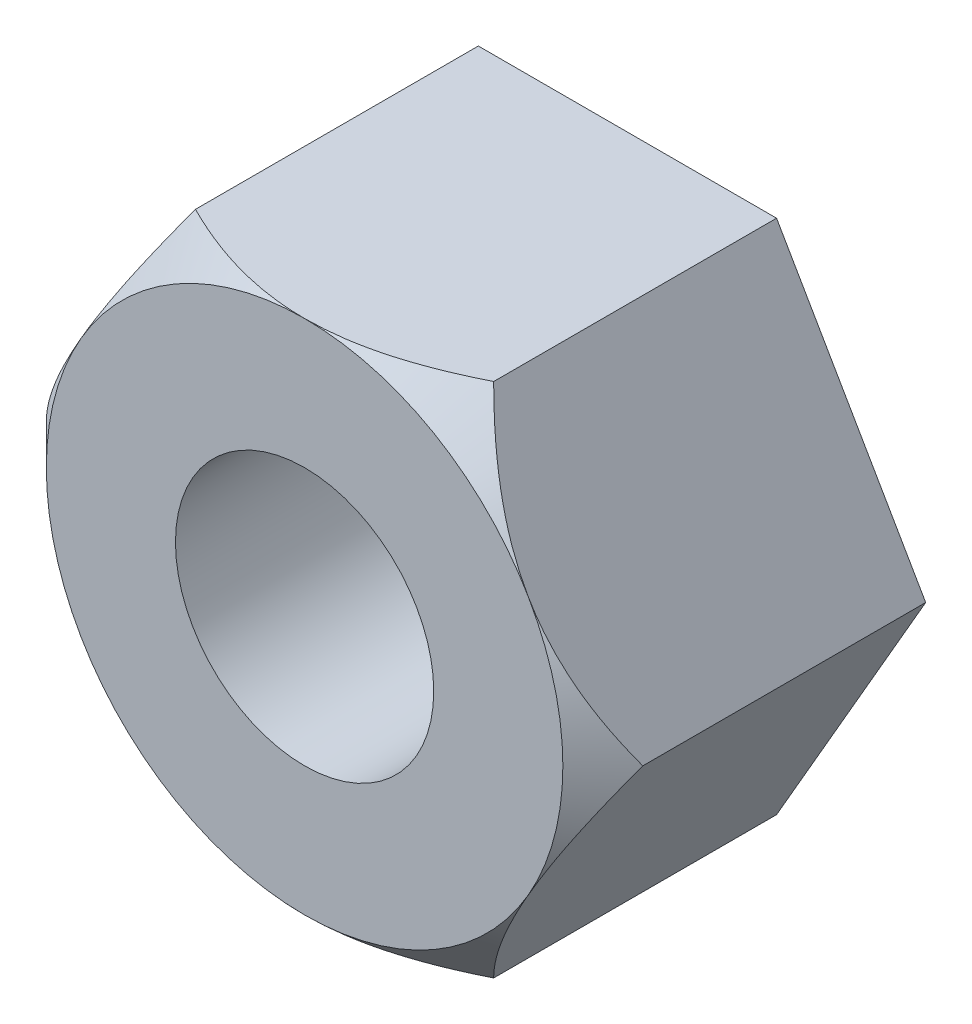
ISO-10303-21;
HEADER;
FILE_DESCRIPTION(('STEP AP214'),'2;1');
FILE_NAME('part.step','',(''),(''),'','','');
FILE_SCHEMA(('AUTOMOTIVE_DESIGN { 1 0 10303 214 1 1 1 1 }'));
ENDSEC;
DATA;
#1=APPLICATION_CONTEXT('core data for automotive mechanical design processes');
#2=APPLICATION_PROTOCOL_DEFINITION('international standard','automotive_design',2000,#1);
#3=PRODUCT_CONTEXT('',#1,'mechanical');
#4=PRODUCT('Part','Part','',(#3));
#5=PRODUCT_RELATED_PRODUCT_CATEGORY('part','',(#4));
#6=PRODUCT_DEFINITION_FORMATION('','',#4);
#7=PRODUCT_DEFINITION_CONTEXT('part definition',#1,'design');
#8=PRODUCT_DEFINITION('design','',#6,#7);
#9=PRODUCT_DEFINITION_SHAPE('','',#8);
#10=(LENGTH_UNIT() NAMED_UNIT(*) SI_UNIT(.MILLI.,.METRE.));
#11=(NAMED_UNIT(*) PLANE_ANGLE_UNIT() SI_UNIT($,.RADIAN.));
#12=(NAMED_UNIT(*) SI_UNIT($,.STERADIAN.) SOLID_ANGLE_UNIT());
#13=UNCERTAINTY_MEASURE_WITH_UNIT(LENGTH_MEASURE(1.E-05),#10,'distance_accuracy_value','');
#14=(GEOMETRIC_REPRESENTATION_CONTEXT(3) GLOBAL_UNCERTAINTY_ASSIGNED_CONTEXT((#13)) GLOBAL_UNIT_ASSIGNED_CONTEXT((#10,
#11,#12)) REPRESENTATION_CONTEXT('',''));
#15=CARTESIAN_POINT('',(0.,0.,0.));
#16=DIRECTION('',(0.,0.,1.));
#17=DIRECTION('',(1.,0.,0.));
#18=AXIS2_PLACEMENT_3D('',#15,#16,#17);
#19=CARTESIAN_POINT('',(0.,0.,5.));
#20=DIRECTION('',(0.,0.,1.));
#21=DIRECTION('',(1.,0.,0.));
#22=AXIS2_PLACEMENT_3D('',#19,#20,#21);
#23=PLANE('',#22);
#24=CARTESIAN_POINT('',(0.,0.,5.));
#25=DIRECTION('',(0.,0.,1.));
#26=DIRECTION('',(1.,0.,0.));
#27=AXIS2_PLACEMENT_3D('',#24,#25,#26);
#28=CIRCLE('',#27,2.);
#29=CARTESIAN_POINT('',(2.,0.,5.));
#30=VERTEX_POINT('',#29);
#31=EDGE_CURVE('E248',#30,#30,#28,.T.);
#32=ORIENTED_EDGE('',*,*,#31,.F.);
#33=EDGE_LOOP('',(#32));
#34=FACE_BOUND('',#33,.T.);
#35=CARTESIAN_POINT('',(0.,0.,5.));
#36=DIRECTION('',(0.,0.,1.));
#37=DIRECTION('',(1.,0.,0.));
#38=AXIS2_PLACEMENT_3D('',#35,#36,#37);
#39=CIRCLE('',#38,4.);
#40=CARTESIAN_POINT('',(3.46410161513775,-2.,5.));
#41=VERTEX_POINT('',#40);
#42=CARTESIAN_POINT('',(3.46410161513775,2.,5.));
#43=VERTEX_POINT('',#42);
#44=EDGE_CURVE('E54',#41,#43,#39,.T.);
#45=ORIENTED_EDGE('',*,*,#44,.T.);
#46=CARTESIAN_POINT('',(0.,4.,5.));
#47=VERTEX_POINT('',#46);
#48=EDGE_CURVE('E137',#43,#47,#39,.T.);
#49=ORIENTED_EDGE('',*,*,#48,.T.);
#50=CARTESIAN_POINT('',(-3.46410161513776,2.,5.));
#51=VERTEX_POINT('',#50);
#52=EDGE_CURVE('E62',#47,#51,#39,.T.);
#53=ORIENTED_EDGE('',*,*,#52,.T.);
#54=CARTESIAN_POINT('',(-3.46410161513775,-2.,5.));
#55=VERTEX_POINT('',#54);
#56=EDGE_CURVE('E136',#51,#55,#39,.T.);
#57=ORIENTED_EDGE('',*,*,#56,.T.);
#58=CARTESIAN_POINT('',(0.,-4.,5.));
#59=VERTEX_POINT('',#58);
#60=EDGE_CURVE('E120',#55,#59,#39,.T.);
#61=ORIENTED_EDGE('',*,*,#60,.T.);
#62=EDGE_CURVE('E110',#59,#41,#39,.T.);
#63=ORIENTED_EDGE('',*,*,#62,.T.);
#64=EDGE_LOOP('',(#45,#49,#53,#57,#61,#63));
#65=FACE_BOUND('',#64,.T.);
#66=ADVANCED_FACE('F33',(#34,#65),#23,.T.);
#67=CARTESIAN_POINT('',(-2.3094010767585,-4.,5.));
#68=DIRECTION('',(0.,1.,0.));
#69=DIRECTION('',(-1.,0.,0.));
#70=AXIS2_PLACEMENT_3D('',#67,#68,#69);
#71=PLANE('',#70);
#72=CARTESIAN_POINT('',(-5.62739378042341,-4.,2.09583019038871));
#73=CARTESIAN_POINT('',(-5.48567305921143,-4.,2.21131320872671));
#74=CARTESIAN_POINT('',(-5.34325635084149,-4.,2.32595576097811));
#75=CARTESIAN_POINT('',(-5.05668167616797,-4.,2.55311778987481));
#76=CARTESIAN_POINT('',(-4.91252327047483,-4.,2.66563671162641));
#77=CARTESIAN_POINT('',(-4.62060451373343,-4.,2.88926285697004));
#78=CARTESIAN_POINT('',(-4.47282202319889,-4.,3.00034127615471));
#79=CARTESIAN_POINT('',(-4.17478915618515,-4.,3.21911632940662));
#80=CARTESIAN_POINT('',(-4.02453901540226,-4.,3.32681328362437));
#81=CARTESIAN_POINT('',(-3.70745510006113,-4.,3.54737733561616));
#82=CARTESIAN_POINT('',(-3.5403410895251,-4.,3.65984385519727));
#83=CARTESIAN_POINT('',(-3.20168901108917,-4.,3.87808322090075));
#84=CARTESIAN_POINT('',(-3.03014957517673,-4.,3.98385396142601));
#85=CARTESIAN_POINT('',(-2.68253937960027,-4.,4.18584518829777));
#86=CARTESIAN_POINT('',(-2.50649297966215,-4.,4.28210720734443));
#87=CARTESIAN_POINT('',(-2.14824323733403,-4.,4.46226913935825));
#88=CARTESIAN_POINT('',(-1.96604522503781,-4.,4.5461794329281));
#89=CARTESIAN_POINT('',(-1.64622345743375,-4.,4.67622145045738));
#90=CARTESIAN_POINT('',(-1.51024779765224,-4.,4.72637711846459));
#91=CARTESIAN_POINT('',(-1.23468247253585,-4.,4.81580743398631));
#92=CARTESIAN_POINT('',(-1.0950923120147,-4.,4.85508058187997));
#93=CARTESIAN_POINT('',(-0.815895099095354,-4.,4.91984416277153));
#94=CARTESIAN_POINT('',(-0.676354340788276,-4.,4.94561557655401));
#95=CARTESIAN_POINT('',(-0.395369685881539,-4.,4.98291662783428));
#96=CARTESIAN_POINT('',(-0.253926226418471,-4.,4.99444948193459));
#97=CARTESIAN_POINT('',(0.0224344397031995,-4.,5.00220491416637));
#98=CARTESIAN_POINT('',(0.157331407433815,-4.,4.99915081559775));
#99=CARTESIAN_POINT('',(0.426139245571594,-4.,4.97960002973554));
#100=CARTESIAN_POINT('',(0.560050041862208,-4.,4.96310234227407));
#101=CARTESIAN_POINT('',(0.828249578460682,-4.,4.91733061597492));
#102=CARTESIAN_POINT('',(0.962497213022141,-4.,4.8878199243241));
#103=CARTESIAN_POINT('',(1.22800919725244,-4.,4.81770490699353));
#104=CARTESIAN_POINT('',(1.35927363611139,-4.,4.77710091344971));
#105=CARTESIAN_POINT('',(1.6231482260178,-4.,4.68505271428975));
#106=CARTESIAN_POINT('',(1.75564045502126,-4.,4.6332745842692));
#107=CARTESIAN_POINT('',(2.01721504448959,-4.,4.52170203451182));
#108=CARTESIAN_POINT('',(2.14629632384763,-4.,4.46190510883379));
#109=CARTESIAN_POINT('',(2.40167335976882,-4.,4.33570236999631));
#110=CARTESIAN_POINT('',(2.52795890447884,-4.,4.26927606143492));
#111=CARTESIAN_POINT('',(2.7776420368556,-4.,4.13127596758793));
#112=CARTESIAN_POINT('',(2.90104005746573,-4.,4.05970296061683));
#113=CARTESIAN_POINT('',(3.13927957475712,-4.,3.91605454237438));
#114=CARTESIAN_POINT('',(3.2542423462294,-4.,3.84417919999285));
#115=CARTESIAN_POINT('',(3.4821925720052,-4.,3.69735268051544));
#116=CARTESIAN_POINT('',(3.59517987850442,-4.,3.62240127466095));
#117=CARTESIAN_POINT('',(3.81853437096097,-4.,3.47057535768083));
#118=CARTESIAN_POINT('',(3.92891526284798,-4.,3.39372093706183));
#119=CARTESIAN_POINT('',(4.14816043183613,-4.,3.23793917826245));
#120=CARTESIAN_POINT('',(4.2570251185156,-4.,3.15901241719142));
#121=CARTESIAN_POINT('',(4.36525322407175,-4.,3.0792368979777));
#122=B_SPLINE_CURVE_WITH_KNOTS('',3,(#72,#73,#74,#75,#76,#77,#78,#79,#80,#81,#82,#83,#84,#85,
#86,#87,#88,#89,#90,#91,#92,#93,#94,#95,#96,#97,#98,#99,#100,#101,#102,#103,#104,#105,#106,#107,
#108,#109,#110,#111,#112,#113,#114,#115,#116,#117,#118,#119,#120,#121),.UNSPECIFIED.,.F.,.F.,(4,
2,2,2,2,2,2,2,2,2,2,2,2,2,2,2,2,2,2,2,2,2,2,2,4),(0.,0.548452642785762,1.09704666298313,
1.65162724367118,2.20615515844462,2.81033793962277,3.41470978169512,4.01631281013551,
4.61740731849236,5.05183569230456,5.48632390099209,5.91136971334838,6.33631948693573,
6.74042244150513,7.14455546302347,7.55636228202611,7.96815677279132,8.39458384249322,
8.82114448615855,9.24906733447408,9.67692560528419,10.0836145854371,10.4903338649609,
10.8938112817737,11.2971775048334),.UNSPECIFIED.);
#123=CARTESIAN_POINT('',(-2.3094010767585,-4.,4.381197846483));
#124=VERTEX_POINT('',#123);
#125=EDGE_CURVE('E125',#124,#59,#122,.T.);
#126=ORIENTED_EDGE('',*,*,#125,.F.);
#127=DIRECTION('',(0.,0.,-1.));
#128=VECTOR('',#127,1.);
#129=CARTESIAN_POINT('',(-2.3094010767585,-4.,5.));
#130=LINE('',#129,#128);
#131=CARTESIAN_POINT('',(-2.3094010767585,-4.,0.));
#132=VERTEX_POINT('',#131);
#133=EDGE_CURVE('E226',#124,#132,#130,.T.);
#134=ORIENTED_EDGE('',*,*,#133,.T.);
#135=DIRECTION('',(1.,0.,0.));
#136=VECTOR('',#135,1.);
#137=CARTESIAN_POINT('',(-2.3094010767585,-4.,0.));
#138=LINE('',#137,#136);
#139=CARTESIAN_POINT('',(2.3094010767585,-4.,0.));
#140=VERTEX_POINT('',#139);
#141=EDGE_CURVE('E243',#132,#140,#138,.T.);
#142=ORIENTED_EDGE('',*,*,#141,.T.);
#143=DIRECTION('',(0.,0.,-1.));
#144=VECTOR('',#143,1.);
#145=CARTESIAN_POINT('',(2.3094010767585,-4.,5.));
#146=LINE('',#145,#144);
#147=CARTESIAN_POINT('',(2.3094010767585,-4.,4.381197846483));
#148=VERTEX_POINT('',#147);
#149=EDGE_CURVE('E134',#148,#140,#146,.T.);
#150=ORIENTED_EDGE('',*,*,#149,.F.);
#151=EDGE_CURVE('E114',#59,#148,#122,.T.);
#152=ORIENTED_EDGE('',*,*,#151,.F.);
#153=EDGE_LOOP('',(#126,#134,#142,#150,#152));
#154=FACE_BOUND('',#153,.T.);
#155=ADVANCED_FACE('F35',(#154),#71,.F.);
#156=CARTESIAN_POINT('',(2.3094010767585,-4.,5.));
#157=DIRECTION('',(-0.866025403784438,0.5,0.));
#158=DIRECTION('',(-0.5,-0.866025403784439,0.));
#159=AXIS2_PLACEMENT_3D('',#156,#157,#158);
#160=PLANE('',#159);
#161=CARTESIAN_POINT('',(2.30928560670466,-4.0002,4.38108237209914));
#162=CARTESIAN_POINT('',(2.34899632674695,-3.93141901528161,4.42078899052544));
#163=CARTESIAN_POINT('',(2.3890109267086,-3.8621116951035,4.45927742936985));
#164=CARTESIAN_POINT('',(2.46971048312824,-3.7223359632364,4.53344662274749));
#165=CARTESIAN_POINT('',(2.51039579126537,-3.65186694242129,4.56912584375136));
#166=CARTESIAN_POINT('',(2.63392971018403,-3.43789991839609,4.67169697883201));
#167=CARTESIAN_POINT('',(2.71782823500144,-3.29258341073225,4.73368473547044));
#168=CARTESIAN_POINT('',(2.88698352725107,-2.99959785018674,4.8398419774736));
#169=CARTESIAN_POINT('',(2.97219756726618,-2.85200280336235,4.88427879102956));
#170=CARTESIAN_POINT('',(3.14450730387843,-2.55355358491113,4.95274886435355));
#171=CARTESIAN_POINT('',(3.23159772331382,-2.40270855359656,4.97683320862169));
#172=CARTESIAN_POINT('',(3.3816946243828,-2.14273309488643,4.99856296562247));
#173=CARTESIAN_POINT('',(3.44450772236846,-2.03393761779447,5.00177893184214));
#174=CARTESIAN_POINT('',(3.57003196860173,-1.81652324573667,4.996357788258));
#175=CARTESIAN_POINT('',(3.63274307339633,-1.70790442603364,4.98771652331117));
#176=CARTESIAN_POINT('',(3.75757108217471,-1.49169597262184,4.95907380798657));
#177=CARTESIAN_POINT('',(3.81968724243515,-1.38410762707966,4.93905965193173));
#178=CARTESIAN_POINT('',(3.94285275199687,-1.17077870677865,4.88876368911834));
#179=CARTESIAN_POINT('',(4.00390218271577,-1.06503799100035,4.85848266960463));
#180=CARTESIAN_POINT('',(4.11227961083268,-0.877322779108233,4.79618259378877));
#181=CARTESIAN_POINT('',(4.15984755582569,-0.794932681568685,4.76580156662289));
#182=CARTESIAN_POINT('',(4.25412951504789,-0.631631537958701,4.70014338192266));
#183=CARTESIAN_POINT('',(4.30084350325072,-0.550720536967234,4.66486607544322));
#184=CARTESIAN_POINT('',(4.39327037218424,-0.390632503989864,4.59020615946207));
#185=CARTESIAN_POINT('',(4.43898588170052,-0.311450918813759,4.5508364594794));
#186=CARTESIAN_POINT('',(4.52957030284816,-0.154554099011843,4.4685087383397));
#187=CARTESIAN_POINT('',(4.57443971345263,-0.0768380001392334,4.42555291868105));
#188=CARTESIAN_POINT('',(4.61891762357084,0.000200000000001252,4.38108237209914));
#189=B_SPLINE_CURVE_WITH_KNOTS('',3,(#161,#162,#163,#164,#165,#166,#167,#168,#169,#170,#171,
#172,#173,#174,#175,#176,#177,#178,#179,#180,#181,#182,#183,#184,#185,#186,#187,#188),
.UNSPECIFIED.,.F.,.F.,(4,2,2,2,2,2,2,2,2,2,2,2,2,4),(0.,0.266361961703664,0.532868334400112,
1.06875865685462,1.59613884594051,2.1221913505558,2.49866160599658,2.87526382203494,
3.25228760372077,3.62928248242858,3.92874944437161,4.22822551811345,4.52678401907574,
4.82516056577921),.UNSPECIFIED.);
#190=EDGE_CURVE('E116',#148,#41,#189,.T.);
#191=ORIENTED_EDGE('',*,*,#190,.F.);
#192=ORIENTED_EDGE('',*,*,#149,.T.);
#193=DIRECTION('',(0.5,0.866025403784438,0.));
#194=VECTOR('',#193,1.);
#195=CARTESIAN_POINT('',(2.3094010767585,-4.,0.));
#196=LINE('',#195,#194);
#197=CARTESIAN_POINT('',(4.61880215351701,0.,0.));
#198=VERTEX_POINT('',#197);
#199=EDGE_CURVE('E239',#140,#198,#196,.T.);
#200=ORIENTED_EDGE('',*,*,#199,.T.);
#201=DIRECTION('',(0.,0.,-1.));
#202=VECTOR('',#201,1.);
#203=CARTESIAN_POINT('',(4.61880215351701,0.,5.));
#204=LINE('',#203,#202);
#205=CARTESIAN_POINT('',(4.61880215351701,0.,4.381197846483));
#206=VERTEX_POINT('',#205);
#207=EDGE_CURVE('E235',#206,#198,#204,.T.);
#208=ORIENTED_EDGE('',*,*,#207,.F.);
#209=EDGE_CURVE('E172',#41,#206,#189,.T.);
#210=ORIENTED_EDGE('',*,*,#209,.F.);
#211=EDGE_LOOP('',(#191,#192,#200,#208,#210));
#212=FACE_BOUND('',#211,.T.);
#213=ADVANCED_FACE('F181',(#212),#160,.F.);
#214=CARTESIAN_POINT('',(4.61880215351701,0.,5.));
#215=DIRECTION('',(-0.866025403784438,-0.5,0.));
#216=DIRECTION('',(0.5,-0.866025403784438,0.));
#217=AXIS2_PLACEMENT_3D('',#214,#215,#216);
#218=PLANE('',#217);
#219=CARTESIAN_POINT('',(4.61891762357084,-0.000199999999998909,4.38108237209914));
#220=CARTESIAN_POINT('',(4.57920690352856,0.0685809847183848,4.42078899052544));
#221=CARTESIAN_POINT('',(4.53919230356691,0.137888304896503,4.45927742936985));
#222=CARTESIAN_POINT('',(4.45849274714727,0.277664036763596,4.53344662274749));
#223=CARTESIAN_POINT('',(4.41780743901013,0.348133057578707,4.56912584375136));
#224=CARTESIAN_POINT('',(4.29427352009148,0.562100081603905,4.67169697883201));
#225=CARTESIAN_POINT('',(4.21037499527406,0.707416589267748,4.73368473547044));
#226=CARTESIAN_POINT('',(4.04121970302444,1.00040214981326,4.83984197747359));
#227=CARTESIAN_POINT('',(3.95600566300932,1.14799719663765,4.88427879102956));
#228=CARTESIAN_POINT('',(3.78369592639708,1.44644641508887,4.95274886435355));
#229=CARTESIAN_POINT('',(3.69660550696169,1.59729144640344,4.97683320862169));
#230=CARTESIAN_POINT('',(3.54650860589271,1.85726690511357,4.99856296562247));
#231=CARTESIAN_POINT('',(3.48369550790704,1.96606238220553,5.00177893184214));
#232=CARTESIAN_POINT('',(3.35817126167378,2.18347675426333,4.996357788258));
#233=CARTESIAN_POINT('',(3.29546015687918,2.29209557396636,4.98771652331117));
#234=CARTESIAN_POINT('',(3.1706321481008,2.50830402737816,4.95907380798656));
#235=CARTESIAN_POINT('',(3.10851598784036,2.61589237292034,4.93905965193173));
#236=CARTESIAN_POINT('',(2.98535047827864,2.82922129322135,4.88876368911834));
#237=CARTESIAN_POINT('',(2.92430104755973,2.93496200899965,4.85848266960463));
#238=CARTESIAN_POINT('',(2.81592361944283,3.12267722089177,4.79618259378877));
#239=CARTESIAN_POINT('',(2.76835567444981,3.20506731843132,4.76580156662289));
#240=CARTESIAN_POINT('',(2.67407371522761,3.3683684620413,4.70014338192266));
#241=CARTESIAN_POINT('',(2.62735972702479,3.44927946303277,4.66486607544322));
#242=CARTESIAN_POINT('',(2.53493285809127,3.60936749601014,4.59020615946207));
#243=CARTESIAN_POINT('',(2.48921734857498,3.68854908118624,4.5508364594794));
#244=CARTESIAN_POINT('',(2.39863292742735,3.84544590098816,4.4685087383397));
#245=CARTESIAN_POINT('',(2.35376351682288,3.92316199986077,4.42555291868104));
#246=CARTESIAN_POINT('',(2.30928560670466,4.0002,4.38108237209914));
#247=B_SPLINE_CURVE_WITH_KNOTS('',3,(#219,#220,#221,#222,#223,#224,#225,#226,#227,#228,#229,
#230,#231,#232,#233,#234,#235,#236,#237,#238,#239,#240,#241,#242,#243,#244,#245,#246),
.UNSPECIFIED.,.F.,.F.,(4,2,2,2,2,2,2,2,2,2,2,2,2,4),(0.,0.266361961703664,0.532868334400112,
1.06875865685462,1.59613884594051,2.1221913505558,2.49866160599658,2.87526382203495,
3.25228760372077,3.62928248242858,3.92874944437161,4.22822551811345,4.52678401907574,
4.82516056577921),.UNSPECIFIED.);
#248=EDGE_CURVE('E176',#206,#43,#247,.T.);
#249=ORIENTED_EDGE('',*,*,#248,.F.);
#250=ORIENTED_EDGE('',*,*,#207,.T.);
#251=DIRECTION('',(-0.5,0.866025403784438,0.));
#252=VECTOR('',#251,1.);
#253=CARTESIAN_POINT('',(4.61880215351701,0.,0.));
#254=LINE('',#253,#252);
#255=CARTESIAN_POINT('',(2.3094010767585,4.,0.));
#256=VERTEX_POINT('',#255);
#257=EDGE_CURVE('E246',#198,#256,#254,.T.);
#258=ORIENTED_EDGE('',*,*,#257,.T.);
#259=DIRECTION('',(0.,0.,-1.));
#260=VECTOR('',#259,1.);
#261=CARTESIAN_POINT('',(2.3094010767585,4.,5.));
#262=LINE('',#261,#260);
#263=CARTESIAN_POINT('',(2.3094010767585,4.,4.381197846483));
#264=VERTEX_POINT('',#263);
#265=EDGE_CURVE('E228',#264,#256,#262,.T.);
#266=ORIENTED_EDGE('',*,*,#265,.F.);
#267=EDGE_CURVE('E166',#43,#264,#247,.T.);
#268=ORIENTED_EDGE('',*,*,#267,.F.);
#269=EDGE_LOOP('',(#249,#250,#258,#266,#268));
#270=FACE_BOUND('',#269,.T.);
#271=ADVANCED_FACE('F184',(#270),#218,.F.);
#272=CARTESIAN_POINT('',(2.3094010767585,4.,5.));
#273=DIRECTION('',(0.,-1.,0.));
#274=DIRECTION('',(0.,0.,-1.));
#275=AXIS2_PLACEMENT_3D('',#272,#273,#274);
#276=PLANE('',#275);
#277=CARTESIAN_POINT('',(-5.62739378037058,4.,2.09583019043177));
#278=CARTESIAN_POINT('',(-5.4856730591602,4.,2.21131320876811));
#279=CARTESIAN_POINT('',(-5.34325635079185,4.,2.32595576101785));
#280=CARTESIAN_POINT('',(-5.05668167612154,4.,2.55311778991123));
#281=CARTESIAN_POINT('',(-4.91252327043001,4.,2.66563671166116));
#282=CARTESIAN_POINT('',(-4.62060451369188,4.,2.88926285700145));
#283=CARTESIAN_POINT('',(-4.47282202315901,4.,3.00034127618443));
#284=CARTESIAN_POINT('',(-4.17478915614862,4.,3.21911632943298));
#285=CARTESIAN_POINT('',(-4.02453901536742,4.,3.32681328364907));
#286=CARTESIAN_POINT('',(-3.70745510003005,4.,3.54737733563727));
#287=CARTESIAN_POINT('',(-3.5403410894961,4.,3.65984385521647));
#288=CARTESIAN_POINT('',(-3.2016890110644,4.,3.8780832209162));
#289=CARTESIAN_POINT('',(-3.03014957515411,4.,3.98385396143964));
#290=CARTESIAN_POINT('',(-2.68253937958203,4.,4.18584518830789));
#291=CARTESIAN_POINT('',(-2.50649297964614,4.,4.28210720735287));
#292=CARTESIAN_POINT('',(-2.14824323732263,4.,4.46226913936358));
#293=CARTESIAN_POINT('',(-1.9660452250288,4.,4.54617943293199));
#294=CARTESIAN_POINT('',(-1.64622345742636,4.,4.67622145046022));
#295=CARTESIAN_POINT('',(-1.51024779764398,4.,4.72637711846753));
#296=CARTESIAN_POINT('',(-1.23468247252582,4.,4.8158074339893));
#297=CARTESIAN_POINT('',(-1.09509231200377,4.,4.85508058188289));
#298=CARTESIAN_POINT('',(-0.815895099082648,4.,4.9198441627741));
#299=CARTESIAN_POINT('',(-0.676354340774697,4.,4.9456155765563));
#300=CARTESIAN_POINT('',(-0.395369685866239,4.,4.98291662783582));
#301=CARTESIAN_POINT('',(-0.253926226402321,4.,4.99444948193564));
#302=CARTESIAN_POINT('',(0.0224344397207552,4.,5.00220491416629));
#303=CARTESIAN_POINT('',(0.157331407451929,4.,4.99915081559705));
#304=CARTESIAN_POINT('',(0.426139245590757,4.,4.97960002973352));
#305=CARTESIAN_POINT('',(0.560050041881861,4.,4.96310234227136));
#306=CARTESIAN_POINT('',(0.828249578481303,4.,4.91733061597075));
#307=CARTESIAN_POINT('',(0.962497213043236,4.,4.88781992431917));
#308=CARTESIAN_POINT('',(1.22800919727443,4.,4.81770490698708));
#309=CARTESIAN_POINT('',(1.3592736361338,4.,4.7771009134425));
#310=CARTESIAN_POINT('',(1.62314822604276,4.,4.68505271428041));
#311=CARTESIAN_POINT('',(1.7556404550483,4.,4.63327458425837));
#312=CARTESIAN_POINT('',(2.0172150445207,4.,4.52170203449784));
#313=CARTESIAN_POINT('',(2.14629632388072,4.,4.46190510881817));
#314=CARTESIAN_POINT('',(2.40167335980579,4.,4.3357023699773));
#315=CARTESIAN_POINT('',(2.52795890451772,4.,4.26927606141416));
#316=CARTESIAN_POINT('',(2.77764203689823,4.,4.13127596756364));
#317=CARTESIAN_POINT('',(2.9010400575102,4.,4.05970296059074));
#318=CARTESIAN_POINT('',(3.13927957480494,4.,3.91605454234487));
#319=CARTESIAN_POINT('',(3.25424234627872,4.,3.84417919996174));
#320=CARTESIAN_POINT('',(3.4821925720575,4.,3.69735268048111));
#321=CARTESIAN_POINT('',(3.5951798785582,4.,3.622401274625));
#322=CARTESIAN_POINT('',(3.81853437101767,4.,3.47057535764168));
#323=CARTESIAN_POINT('',(3.92891526290613,4.,3.39372093702108));
#324=CARTESIAN_POINT('',(4.14816043189716,4.,3.23793917821852));
#325=CARTESIAN_POINT('',(4.25702511857807,4.,3.15901241714589));
#326=CARTESIAN_POINT('',(4.36525322413565,4.,3.07923689793059));
#327=B_SPLINE_CURVE_WITH_KNOTS('',3,(#277,#278,#279,#280,#281,#282,#283,#284,#285,#286,#287,
#288,#289,#290,#291,#292,#293,#294,#295,#296,#297,#298,#299,#300,#301,#302,#303,#304,#305,#306,
#307,#308,#309,#310,#311,#312,#313,#314,#315,#316,#317,#318,#319,#320,#321,#322,#323,#324,#325,
#326),.UNSPECIFIED.,.F.,.F.,(4,2,2,2,2,2,2,2,2,2,2,2,2,2,2,2,2,2,2,2,2,2,2,2,4),(0.,
0.548452642778899,1.0970466629694,1.65162724365041,2.20615515841682,2.8103379395866,
3.41470978165058,4.01631281008268,4.61740731843128,5.05183569224602,5.48632390093609,
5.91136971329478,6.33631948688454,6.74042244145565,7.14455546297571,7.55636228198022,
7.96815677274731,8.39458384245666,8.82114448612944,9.24906733445248,9.67692560527008,
10.0836145854294,10.4903338649596,10.8938112817786,11.2971775048446),.UNSPECIFIED.);
#328=EDGE_CURVE('E260',#264,#47,#327,.F.);
#329=ORIENTED_EDGE('',*,*,#328,.F.);
#330=ORIENTED_EDGE('',*,*,#265,.T.);
#331=DIRECTION('',(-1.,0.,0.));
#332=VECTOR('',#331,1.);
#333=CARTESIAN_POINT('',(2.3094010767585,4.,0.));
#334=LINE('',#333,#332);
#335=CARTESIAN_POINT('',(-2.3094010767585,4.,0.));
#336=VERTEX_POINT('',#335);
#337=EDGE_CURVE('E254',#256,#336,#334,.T.);
#338=ORIENTED_EDGE('',*,*,#337,.T.);
#339=DIRECTION('',(0.,0.,-1.));
#340=VECTOR('',#339,1.);
#341=CARTESIAN_POINT('',(-2.3094010767585,4.,5.));
#342=LINE('',#341,#340);
#343=CARTESIAN_POINT('',(-2.3094010767585,4.,4.381197846483));
#344=VERTEX_POINT('',#343);
#345=EDGE_CURVE('E225',#344,#336,#342,.T.);
#346=ORIENTED_EDGE('',*,*,#345,.F.);
#347=EDGE_CURVE('E147',#47,#344,#327,.F.);
#348=ORIENTED_EDGE('',*,*,#347,.F.);
#349=EDGE_LOOP('',(#329,#330,#338,#346,#348));
#350=FACE_BOUND('',#349,.T.);
#351=ADVANCED_FACE('F188',(#350),#276,.F.);
#352=CARTESIAN_POINT('',(-2.3094010767585,4.,5.));
#353=DIRECTION('',(0.866025403784438,-0.5,0.));
#354=DIRECTION('',(0.5,0.866025403784439,0.));
#355=AXIS2_PLACEMENT_3D('',#352,#353,#354);
#356=PLANE('',#355);
#357=CARTESIAN_POINT('',(-2.30928560670466,4.0002,4.38108237209914));
#358=CARTESIAN_POINT('',(-2.34899632674695,3.93141901528162,4.42078899052544));
#359=CARTESIAN_POINT('',(-2.3890109267086,3.8621116951035,4.45927742936985));
#360=CARTESIAN_POINT('',(-2.46971048312824,3.72233596323641,4.53344662274749));
#361=CARTESIAN_POINT('',(-2.51039579126538,3.65186694242129,4.56912584375136));
#362=CARTESIAN_POINT('',(-2.63392971018403,3.4378999183961,4.67169697883201));
#363=CARTESIAN_POINT('',(-2.71782823500144,3.29258341073225,4.73368473547044));
#364=CARTESIAN_POINT('',(-2.88698352725107,2.99959785018674,4.83984197747359));
#365=CARTESIAN_POINT('',(-2.97219756726618,2.85200280336235,4.88427879102956));
#366=CARTESIAN_POINT('',(-3.14450730387843,2.55355358491113,4.95274886435355));
#367=CARTESIAN_POINT('',(-3.23159772331382,2.40270855359656,4.97683320862169));
#368=CARTESIAN_POINT('',(-3.3816946243828,2.14273309488644,4.99856296562247));
#369=CARTESIAN_POINT('',(-3.44450772236846,2.03393761779447,5.00177893184214));
#370=CARTESIAN_POINT('',(-3.57003196860173,1.81652324573667,4.996357788258));
#371=CARTESIAN_POINT('',(-3.63274307339633,1.70790442603364,4.98771652331117));
#372=CARTESIAN_POINT('',(-3.75757108217471,1.49169597262184,4.95907380798656));
#373=CARTESIAN_POINT('',(-3.81968724243515,1.38410762707966,4.93905965193173));
#374=CARTESIAN_POINT('',(-3.94285275199687,1.17077870677865,4.88876368911834));
#375=CARTESIAN_POINT('',(-4.00390218271578,1.06503799100035,4.85848266960463));
#376=CARTESIAN_POINT('',(-4.11227961083268,0.877322779108234,4.79618259378877));
#377=CARTESIAN_POINT('',(-4.15984755582569,0.794932681568685,4.76580156662289));
#378=CARTESIAN_POINT('',(-4.25412951504789,0.631631537958702,4.70014338192266));
#379=CARTESIAN_POINT('',(-4.30084350325072,0.550720536967235,4.66486607544322));
#380=CARTESIAN_POINT('',(-4.39327037218424,0.390632503989865,4.59020615946207));
#381=CARTESIAN_POINT('',(-4.43898588170053,0.311450918813761,4.5508364594794));
#382=CARTESIAN_POINT('',(-4.52957030284816,0.154554099011845,4.4685087383397));
#383=CARTESIAN_POINT('',(-4.57443971345263,0.0768380001392354,4.42555291868104));
#384=CARTESIAN_POINT('',(-4.61891762357084,-0.000199999999998803,4.38108237209914));
#385=B_SPLINE_CURVE_WITH_KNOTS('',3,(#357,#358,#359,#360,#361,#362,#363,#364,#365,#366,#367,
#368,#369,#370,#371,#372,#373,#374,#375,#376,#377,#378,#379,#380,#381,#382,#383,#384),
.UNSPECIFIED.,.F.,.F.,(4,2,2,2,2,2,2,2,2,2,2,2,2,4),(0.,0.266361961703664,0.532868334400112,
1.06875865685462,1.59613884594051,2.1221913505558,2.49866160599658,2.87526382203494,
3.25228760372077,3.62928248242858,3.92874944437161,4.22822551811345,4.52678401907573,
4.82516056577921),.UNSPECIFIED.);
#386=EDGE_CURVE('E146',#344,#51,#385,.T.);
#387=ORIENTED_EDGE('',*,*,#386,.F.);
#388=ORIENTED_EDGE('',*,*,#345,.T.);
#389=DIRECTION('',(-0.5,-0.866025403784438,0.));
#390=VECTOR('',#389,1.);
#391=CARTESIAN_POINT('',(-2.3094010767585,4.,0.));
#392=LINE('',#391,#390);
#393=CARTESIAN_POINT('',(-4.61880215351701,0.,0.));
#394=VERTEX_POINT('',#393);
#395=EDGE_CURVE('E223',#336,#394,#392,.T.);
#396=ORIENTED_EDGE('',*,*,#395,.T.);
#397=DIRECTION('',(0.,0.,-1.));
#398=VECTOR('',#397,1.);
#399=CARTESIAN_POINT('',(-4.61880215351701,0.,5.));
#400=LINE('',#399,#398);
#401=CARTESIAN_POINT('',(-4.61880215351701,0.,4.381197846483));
#402=VERTEX_POINT('',#401);
#403=EDGE_CURVE('E217',#402,#394,#400,.T.);
#404=ORIENTED_EDGE('',*,*,#403,.F.);
#405=EDGE_CURVE('E140',#51,#402,#385,.T.);
#406=ORIENTED_EDGE('',*,*,#405,.F.);
#407=EDGE_LOOP('',(#387,#388,#396,#404,#406));
#408=FACE_BOUND('',#407,.T.);
#409=ADVANCED_FACE('F153',(#408),#356,.F.);
#410=CARTESIAN_POINT('',(-4.61880215351701,0.,5.));
#411=DIRECTION('',(0.866025403784438,0.5,0.));
#412=DIRECTION('',(-0.5,0.866025403784439,0.));
#413=AXIS2_PLACEMENT_3D('',#410,#411,#412);
#414=PLANE('',#413);
#415=CARTESIAN_POINT('',(-4.61891762357084,0.000200000000001757,4.38108237209914));
#416=CARTESIAN_POINT('',(-4.57920690352856,-0.0685809847183818,4.42078899052544));
#417=CARTESIAN_POINT('',(-4.53919230356691,-0.1378883048965,4.45927742936985));
#418=CARTESIAN_POINT('',(-4.45849274714727,-0.277664036763593,4.53344662274749));
#419=CARTESIAN_POINT('',(-4.41780743901013,-0.348133057578703,4.56912584375136));
#420=CARTESIAN_POINT('',(-4.29427352009148,-0.562100081603902,4.67169697883201));
#421=CARTESIAN_POINT('',(-4.21037499527407,-0.707416589267745,4.73368473547044));
#422=CARTESIAN_POINT('',(-4.04121970302444,-1.00040214981326,4.8398419774736));
#423=CARTESIAN_POINT('',(-3.95600566300932,-1.14799719663765,4.88427879102956));
#424=CARTESIAN_POINT('',(-3.78369592639708,-1.44644641508887,4.95274886435355));
#425=CARTESIAN_POINT('',(-3.69660550696169,-1.59729144640344,4.97683320862169));
#426=CARTESIAN_POINT('',(-3.54650860589271,-1.85726690511356,4.99856296562247));
#427=CARTESIAN_POINT('',(-3.48369550790704,-1.96606238220553,5.00177893184214));
#428=CARTESIAN_POINT('',(-3.35817126167378,-2.18347675426333,4.996357788258));
#429=CARTESIAN_POINT('',(-3.29546015687918,-2.29209557396636,4.98771652331117));
#430=CARTESIAN_POINT('',(-3.1706321481008,-2.50830402737816,4.95907380798657));
#431=CARTESIAN_POINT('',(-3.10851598784036,-2.61589237292034,4.93905965193173));
#432=CARTESIAN_POINT('',(-2.98535047827864,-2.82922129322135,4.88876368911834));
#433=CARTESIAN_POINT('',(-2.92430104755973,-2.93496200899965,4.85848266960463));
#434=CARTESIAN_POINT('',(-2.81592361944283,-3.12267722089177,4.79618259378877));
#435=CARTESIAN_POINT('',(-2.76835567444981,-3.20506731843131,4.76580156662289));
#436=CARTESIAN_POINT('',(-2.67407371522761,-3.3683684620413,4.70014338192266));
#437=CARTESIAN_POINT('',(-2.62735972702479,-3.44927946303276,4.66486607544322));
#438=CARTESIAN_POINT('',(-2.53493285809127,-3.60936749601013,4.59020615946207));
#439=CARTESIAN_POINT('',(-2.48921734857498,-3.68854908118624,4.5508364594794));
#440=CARTESIAN_POINT('',(-2.39863292742735,-3.84544590098815,4.4685087383397));
#441=CARTESIAN_POINT('',(-2.35376351682288,-3.92316199986076,4.42555291868105));
#442=CARTESIAN_POINT('',(-2.30928560670466,-4.0002,4.38108237209914));
#443=B_SPLINE_CURVE_WITH_KNOTS('',3,(#415,#416,#417,#418,#419,#420,#421,#422,#423,#424,#425,
#426,#427,#428,#429,#430,#431,#432,#433,#434,#435,#436,#437,#438,#439,#440,#441,#442),
.UNSPECIFIED.,.F.,.F.,(4,2,2,2,2,2,2,2,2,2,2,2,2,4),(0.,0.266361961703664,0.532868334400111,
1.06875865685462,1.59613884594051,2.12219135055581,2.49866160599658,2.87526382203495,
3.25228760372077,3.62928248242858,3.92874944437161,4.22822551811345,4.52678401907574,
4.82516056577921),.UNSPECIFIED.);
#444=EDGE_CURVE('E11',#402,#55,#443,.T.);
#445=ORIENTED_EDGE('',*,*,#444,.F.);
#446=ORIENTED_EDGE('',*,*,#403,.T.);
#447=DIRECTION('',(0.5,-0.866025403784438,0.));
#448=VECTOR('',#447,1.);
#449=CARTESIAN_POINT('',(-4.61880215351701,0.,0.));
#450=LINE('',#449,#448);
#451=EDGE_CURVE('E230',#394,#132,#450,.T.);
#452=ORIENTED_EDGE('',*,*,#451,.T.);
#453=ORIENTED_EDGE('',*,*,#133,.F.);
#454=EDGE_CURVE('E38',#55,#124,#443,.T.);
#455=ORIENTED_EDGE('',*,*,#454,.F.);
#456=EDGE_LOOP('',(#445,#446,#452,#453,#455));
#457=FACE_BOUND('',#456,.T.);
#458=ADVANCED_FACE('F196',(#457),#414,.F.);
#459=CARTESIAN_POINT('',(0.,0.,0.));
#460=DIRECTION('',(0.,0.,1.));
#461=DIRECTION('',(1.,0.,0.));
#462=AXIS2_PLACEMENT_3D('',#459,#460,#461);
#463=PLANE('',#462);
#464=ORIENTED_EDGE('',*,*,#141,.F.);
#465=ORIENTED_EDGE('',*,*,#451,.F.);
#466=ORIENTED_EDGE('',*,*,#395,.F.);
#467=ORIENTED_EDGE('',*,*,#337,.F.);
#468=ORIENTED_EDGE('',*,*,#257,.F.);
#469=ORIENTED_EDGE('',*,*,#199,.F.);
#470=EDGE_LOOP('',(#464,#465,#466,#467,#468,#469));
#471=FACE_BOUND('',#470,.T.);
#472=CARTESIAN_POINT('',(0.,0.,0.));
#473=DIRECTION('',(0.,0.,1.));
#474=DIRECTION('',(1.,0.,0.));
#475=AXIS2_PLACEMENT_3D('',#472,#473,#474);
#476=CIRCLE('',#475,2.);
#477=CARTESIAN_POINT('',(2.,0.,0.));
#478=VERTEX_POINT('',#477);
#479=EDGE_CURVE('E130',#478,#478,#476,.T.);
#480=ORIENTED_EDGE('',*,*,#479,.T.);
#481=EDGE_LOOP('',(#480));
#482=FACE_BOUND('',#481,.T.);
#483=ADVANCED_FACE('F206',(#471,#482),#463,.F.);
#484=CARTESIAN_POINT('',(0.,0.,5.));
#485=DIRECTION('',(0.,0.,-1.));
#486=DIRECTION('',(-1.,0.,0.));
#487=AXIS2_PLACEMENT_3D('',#484,#485,#486);
#488=CYLINDRICAL_SURFACE('',#487,2.);
#489=ORIENTED_EDGE('',*,*,#31,.T.);
#490=EDGE_LOOP('',(#489));
#491=FACE_BOUND('',#490,.T.);
#492=ORIENTED_EDGE('',*,*,#479,.F.);
#493=EDGE_LOOP('',(#492));
#494=FACE_BOUND('',#493,.T.);
#495=ADVANCED_FACE('F159',(#491,#494),#488,.F.);
#496=CARTESIAN_POINT('',(0.,0.,5.));
#497=DIRECTION('',(0.,0.,-1.));
#498=DIRECTION('',(1.,0.,0.));
#499=AXIS2_PLACEMENT_3D('',#496,#497,#498);
#500=CONICAL_SURFACE('',#499,4.,0.78539816339745);
#501=ORIENTED_EDGE('',*,*,#125,.T.);
#502=ORIENTED_EDGE('',*,*,#60,.F.);
#503=ORIENTED_EDGE('',*,*,#454,.T.);
#504=EDGE_LOOP('',(#501,#502,#503));
#505=FACE_BOUND('',#504,.T.);
#506=ADVANCED_FACE('F126',(#505),#500,.T.);
#507=ORIENTED_EDGE('',*,*,#405,.T.);
#508=ORIENTED_EDGE('',*,*,#444,.T.);
#509=ORIENTED_EDGE('',*,*,#56,.F.);
#510=EDGE_LOOP('',(#507,#508,#509));
#511=FACE_BOUND('',#510,.T.);
#512=ADVANCED_FACE('F158',(#511),#500,.T.);
#513=ORIENTED_EDGE('',*,*,#347,.T.);
#514=ORIENTED_EDGE('',*,*,#386,.T.);
#515=ORIENTED_EDGE('',*,*,#52,.F.);
#516=EDGE_LOOP('',(#513,#514,#515));
#517=FACE_BOUND('',#516,.T.);
#518=ADVANCED_FACE('F266',(#517),#500,.T.);
#519=ORIENTED_EDGE('',*,*,#267,.T.);
#520=ORIENTED_EDGE('',*,*,#328,.T.);
#521=ORIENTED_EDGE('',*,*,#48,.F.);
#522=EDGE_LOOP('',(#519,#520,#521));
#523=FACE_BOUND('',#522,.T.);
#524=ADVANCED_FACE('F265',(#523),#500,.T.);
#525=ORIENTED_EDGE('',*,*,#209,.T.);
#526=ORIENTED_EDGE('',*,*,#248,.T.);
#527=ORIENTED_EDGE('',*,*,#44,.F.);
#528=EDGE_LOOP('',(#525,#526,#527));
#529=FACE_BOUND('',#528,.T.);
#530=ADVANCED_FACE('F262',(#529),#500,.T.);
#531=ORIENTED_EDGE('',*,*,#151,.T.);
#532=ORIENTED_EDGE('',*,*,#190,.T.);
#533=ORIENTED_EDGE('',*,*,#62,.F.);
#534=EDGE_LOOP('',(#531,#532,#533));
#535=FACE_BOUND('',#534,.T.);
#536=ADVANCED_FACE('F112',(#535),#500,.T.);
#537=CLOSED_SHELL('',(#66,#155,#213,#271,#351,#409,#458,#483,#495,#506,#512,#518,#524,#530,#536));
#538=MANIFOLD_SOLID_BREP('B2',#537);
#539=ADVANCED_BREP_SHAPE_REPRESENTATION('',(#18,#538),#14);
#540=SHAPE_DEFINITION_REPRESENTATION(#9,#539);
ENDSEC;
END-ISO-10303-21;
